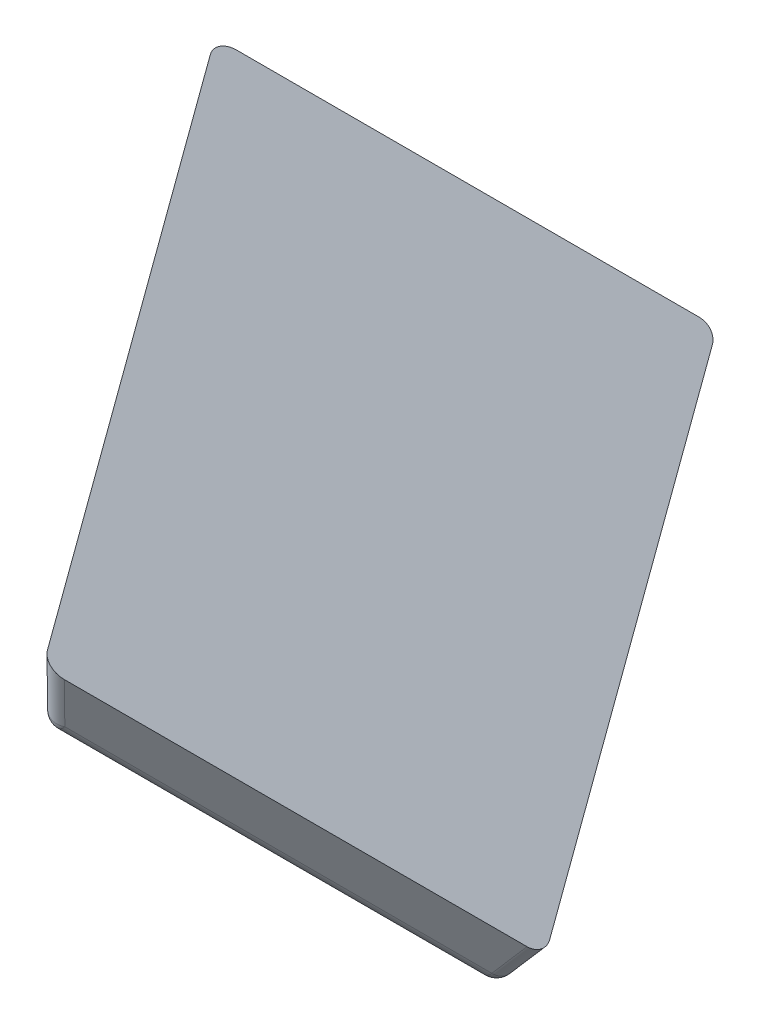
ISO-10303-21;
HEADER;
FILE_DESCRIPTION(('STEP AP214'),'2;1');
FILE_NAME('part.step','',(''),(''),'','','');
FILE_SCHEMA(('AUTOMOTIVE_DESIGN { 1 0 10303 214 1 1 1 1 }'));
ENDSEC;
DATA;
#1=APPLICATION_CONTEXT('core data for automotive mechanical design processes');
#2=APPLICATION_PROTOCOL_DEFINITION('international standard','automotive_design',2000,#1);
#3=PRODUCT_CONTEXT('',#1,'mechanical');
#4=PRODUCT('Part','Part','',(#3));
#5=PRODUCT_RELATED_PRODUCT_CATEGORY('part','',(#4));
#6=PRODUCT_DEFINITION_FORMATION('','',#4);
#7=PRODUCT_DEFINITION_CONTEXT('part definition',#1,'design');
#8=PRODUCT_DEFINITION('design','',#6,#7);
#9=PRODUCT_DEFINITION_SHAPE('','',#8);
#10=(LENGTH_UNIT() NAMED_UNIT(*) SI_UNIT(.MILLI.,.METRE.));
#11=(NAMED_UNIT(*) PLANE_ANGLE_UNIT() SI_UNIT($,.RADIAN.));
#12=(NAMED_UNIT(*) SI_UNIT($,.STERADIAN.) SOLID_ANGLE_UNIT());
#13=UNCERTAINTY_MEASURE_WITH_UNIT(LENGTH_MEASURE(1.E-05),#10,'distance_accuracy_value','');
#14=(GEOMETRIC_REPRESENTATION_CONTEXT(3) GLOBAL_UNCERTAINTY_ASSIGNED_CONTEXT((#13)) GLOBAL_UNIT_ASSIGNED_CONTEXT((#10,
#11,#12)) REPRESENTATION_CONTEXT('',''));
#15=CARTESIAN_POINT('',(0.,0.,0.));
#16=DIRECTION('',(0.,0.,1.));
#17=DIRECTION('',(1.,0.,0.));
#18=AXIS2_PLACEMENT_3D('',#15,#16,#17);
#19=CARTESIAN_POINT('',(10.8333333333333,10.8333333333333,10.8333333333333));
#20=DIRECTION('',(-0.577350269189626,-0.577350269189626,-0.577350269189626));
#21=DIRECTION('',(-0.707106781186548,0.,0.707106781186547));
#22=AXIS2_PLACEMENT_3D('',#19,#20,#21);
#23=PLANE('',#22);
#24=DIRECTION('',(-0.505076272276105,-0.303045763365663,0.808122035641769));
#25=VECTOR('',#24,1.);
#26=CARTESIAN_POINT('',(0.,12.5,20.));
#27=LINE('',#26,#25);
#28=CARTESIAN_POINT('',(12.5,20.,0.));
#29=VERTEX_POINT('',#28);
#30=CARTESIAN_POINT('',(8.57321409974115,17.6439284598447,6.28285744041417));
#31=VERTEX_POINT('',#30);
#32=EDGE_CURVE('E141',#29,#31,#27,.T.);
#33=ORIENTED_EDGE('',*,*,#32,.F.);
#34=DIRECTION('',(0.303045763365663,-0.808122035641769,0.505076272276105));
#35=VECTOR('',#34,1.);
#36=CARTESIAN_POINT('',(12.5,20.,0.));
#37=LINE('',#36,#35);
#38=CARTESIAN_POINT('',(15.6996033261369,11.4677244636351,5.33267221022809));
#39=VERTEX_POINT('',#38);
#40=EDGE_CURVE('E144',#29,#39,#37,.T.);
#41=ORIENTED_EDGE('',*,*,#40,.T.);
#42=DIRECTION('',(0.751882060675628,-0.651631119252211,-0.100250941423417));
#43=VECTOR('',#42,1.);
#44=CARTESIAN_POINT('',(12.8447683722044,13.9419147570432,5.71331687075242));
#45=LINE('',#44,#43);
#46=EDGE_CURVE('E139',#31,#39,#45,.T.);
#47=ORIENTED_EDGE('',*,*,#46,.F.);
#48=EDGE_LOOP('',(#33,#41,#47));
#49=FACE_BOUND('',#48,.T.);
#50=ADVANCED_FACE('F43',(#49),#23,.T.);
#51=CARTESIAN_POINT('',(0.,17.5342465753425,-6.57534246575342));
#52=DIRECTION('',(0.,-0.936329177569045,0.351123441588392));
#53=DIRECTION('',(0.,-0.351123441588392,-0.936329177569045));
#54=AXIS2_PLACEMENT_3D('',#51,#52,#53);
#55=PLANE('',#54);
#56=DIRECTION('',(-0.505076272276106,-0.303045763365663,-0.808122035641769));
#57=VECTOR('',#56,1.);
#58=CARTESIAN_POINT('',(12.5,20.,0.));
#59=LINE('',#58,#57);
#60=CARTESIAN_POINT('',(6.96222501245545,16.6773350074733,-8.86043998007128));
#61=VERTEX_POINT('',#60);
#62=EDGE_CURVE('E167',#29,#61,#59,.T.);
#63=ORIENTED_EDGE('',*,*,#62,.F.);
#64=DIRECTION('',(1.,0.,0.));
#65=VECTOR('',#64,1.);
#66=CARTESIAN_POINT('',(12.5,20.,0.));
#67=LINE('',#66,#65);
#68=CARTESIAN_POINT('',(4.64642819948229,20.,0.));
#69=VERTEX_POINT('',#68);
#70=EDGE_CURVE('E156',#69,#29,#67,.T.);
#71=ORIENTED_EDGE('',*,*,#70,.F.);
#72=DIRECTION('',(-0.237707846515021,0.341059084130247,0.909490891013994));
#73=VECTOR('',#72,1.);
#74=CARTESIAN_POINT('',(6.00533008823189,18.0502712030984,-5.19927679173765));
#75=LINE('',#74,#73);
#76=EDGE_CURVE('E162',#61,#69,#75,.T.);
#77=ORIENTED_EDGE('',*,*,#76,.F.);
#78=EDGE_LOOP('',(#63,#71,#77));
#79=FACE_BOUND('',#78,.T.);
#80=ADVANCED_FACE('F206',(#79),#55,.T.);
#81=CARTESIAN_POINT('',(10.8333333333333,10.8333333333333,-10.8333333333333));
#82=DIRECTION('',(-0.577350269189626,-0.577350269189626,0.577350269189626));
#83=DIRECTION('',(0.,-0.707106781186548,-0.707106781186547));
#84=AXIS2_PLACEMENT_3D('',#81,#82,#83);
#85=PLANE('',#84);
#86=DIRECTION('',(-0.303045763365663,0.808122035641769,0.505076272276105));
#87=VECTOR('',#86,1.);
#88=CARTESIAN_POINT('',(20.,0.,-12.5));
#89=LINE('',#88,#87);
#90=CARTESIAN_POINT('',(16.7486535970014,8.67025707466293,-7.08108932833567));
#91=VERTEX_POINT('',#90);
#92=EDGE_CURVE('E171',#91,#29,#89,.T.);
#93=ORIENTED_EDGE('',*,*,#92,.T.);
#94=ORIENTED_EDGE('',*,*,#62,.T.);
#95=DIRECTION('',(-0.76640631572078,0.627059712862456,-0.139346602858323));
#96=VECTOR('',#95,1.);
#97=CARTESIAN_POINT('',(11.8338590842725,12.6914525850775,-7.97468833065001));
#98=LINE('',#97,#96);
#99=EDGE_CURVE('E150',#91,#61,#98,.T.);
#100=ORIENTED_EDGE('',*,*,#99,.F.);
#101=EDGE_LOOP('',(#93,#94,#100));
#102=FACE_BOUND('',#101,.T.);
#103=ADVANCED_FACE('F275',(#102),#85,.T.);
#104=CARTESIAN_POINT('',(0.,17.5342465753425,6.57534246575342));
#105=DIRECTION('',(0.,0.936329177569044,0.351123441588392));
#106=DIRECTION('',(0.,-0.351123441588392,0.936329177569045));
#107=AXIS2_PLACEMENT_3D('',#104,#105,#106);
#108=PLANE('',#107);
#109=DIRECTION('',(-0.505076272276105,0.303045763365663,-0.808122035641769));
#110=VECTOR('',#109,1.);
#111=CARTESIAN_POINT('',(6.52233937308375,18.8744532958391,3.00145787776232));
#112=LINE('',#111,#110);
#113=EDGE_CURVE('E149',#31,#69,#112,.T.);
#114=ORIENTED_EDGE('',*,*,#113,.T.);
#115=ORIENTED_EDGE('',*,*,#70,.T.);
#116=ORIENTED_EDGE('',*,*,#32,.T.);
#117=EDGE_LOOP('',(#114,#115,#116));
#118=FACE_BOUND('',#117,.T.);
#119=ADVANCED_FACE('F154',(#118),#108,.F.);
#120=CARTESIAN_POINT('',(17.5342465753425,6.57534246575343,0.));
#121=DIRECTION('',(0.936329177569044,0.351123441588392,0.));
#122=DIRECTION('',(-0.351123441588392,0.936329177569045,0.));
#123=AXIS2_PLACEMENT_3D('',#120,#121,#122);
#124=PLANE('',#123);
#125=DIRECTION('',(-0.0821609511956188,0.219095869854983,0.972237922481488));
#126=VECTOR('',#125,1.);
#127=CARTESIAN_POINT('',(16.2260301384986,10.0639196306704,-0.896711736052602));
#128=LINE('',#127,#126);
#129=EDGE_CURVE('E158',#91,#39,#128,.T.);
#130=ORIENTED_EDGE('',*,*,#129,.T.);
#131=ORIENTED_EDGE('',*,*,#40,.F.);
#132=ORIENTED_EDGE('',*,*,#92,.F.);
#133=EDGE_LOOP('',(#130,#131,#132));
#134=FACE_BOUND('',#133,.T.);
#135=ADVANCED_FACE('F202',(#134),#124,.F.);
#136=CARTESIAN_POINT('',(15.4893948071537,18.3056484084544,-2.81625360130067));
#137=DIRECTION('',(0.641533027871785,0.758175396575746,-0.116642368703961));
#138=DIRECTION('',(-0.763386285369115,0.645942241466174,0.));
#139=AXIS2_PLACEMENT_3D('',#136,#137,#138);
#140=PLANE('',#139);
#141=DIRECTION('',(0.577350269189626,-0.577350269189626,-0.577350269189625));
#142=VECTOR('',#141,1.);
#143=CARTESIAN_POINT('',(40.542704217538,-1.19182200689278,8.24339045605658));
#144=LINE('',#143,#142);
#145=CARTESIAN_POINT('',(17.2770908843878,22.0737913262574,31.5090037892067));
#146=VERTEX_POINT('',#145);
#147=CARTESIAN_POINT('',(39.6766788137536,-0.325796603108337,9.10941585984101));
#148=VERTEX_POINT('',#147);
#149=EDGE_CURVE('E47',#146,#148,#144,.T.);
#150=ORIENTED_EDGE('',*,*,#149,.T.);
#151=CARTESIAN_POINT('',(38.9190644053394,0.128772041940155,7.89723280637836));
#152=DIRECTION('',(0.641533027871785,0.758175396575746,-0.116642368703961));
#153=DIRECTION('',(-0.763386285369115,0.645942241466174,0.));
#154=AXIS2_PLACEMENT_3D('',#151,#152,#153);
#155=CIRCLE('',#154,1.5);
#156=CARTESIAN_POINT('',(39.7850898091238,-0.737253361844284,7.03120740259393));
#157=VERTEX_POINT('',#156);
#158=EDGE_CURVE('E404',#148,#157,#155,.T.);
#159=ORIENTED_EDGE('',*,*,#158,.T.);
#160=DIRECTION('',(-0.505076272276105,0.303045763365663,-0.808122035641769));
#161=VECTOR('',#160,1.);
#162=CARTESIAN_POINT('',(12.7635092423522,15.4756949782187,-36.2033215042407));
#163=LINE('',#162,#161);
#164=CARTESIAN_POINT('',(13.5211236507664,15.0211263331702,-34.991138450778));
#165=VERTEX_POINT('',#164);
#166=EDGE_CURVE('E389',#157,#165,#163,.T.);
#167=ORIENTED_EDGE('',*,*,#166,.T.);
#168=CARTESIAN_POINT('',(12.6550982469819,15.8871517369546,-34.1251130469936));
#169=DIRECTION('',(0.641533027871785,0.758175396575746,-0.116642368703961));
#170=DIRECTION('',(-0.763386285369115,0.645942241466174,0.));
#171=AXIS2_PLACEMENT_3D('',#168,#169,#170);
#172=CIRCLE('',#171,1.5);
#173=CARTESIAN_POINT('',(11.8974838385678,16.3417203820031,-35.3372961004563));
#174=VERTEX_POINT('',#173);
#175=EDGE_CURVE('E397',#165,#174,#172,.T.);
#176=ORIENTED_EDGE('',*,*,#175,.T.);
#177=DIRECTION('',(-0.577350269189626,0.577350269189626,0.577350269189625));
#178=VECTOR('',#177,1.);
#179=CARTESIAN_POINT('',(12.7635092423522,15.4756949782187,-36.2033215042407));
#180=LINE('',#179,#178);
#181=CARTESIAN_POINT('',(-10.502104090798,38.7413083113689,-12.9377081710905));
#182=VERTEX_POINT('',#181);
#183=EDGE_CURVE('E388',#174,#182,#180,.T.);
#184=ORIENTED_EDGE('',*,*,#183,.T.);
#185=CARTESIAN_POINT('',(-9.74448968238383,38.2867396663204,-11.7255251176279));
#186=DIRECTION('',(0.641533027871785,0.758175396575746,-0.116642368703961));
#187=DIRECTION('',(-0.577350269189627,0.577350269189626,0.577350269189624));
#188=AXIS2_PLACEMENT_3D('',#185,#186,#187);
#189=ELLIPSE('',#188,1.80277563773199,1.5);
#190=CARTESIAN_POINT('',(-10.7853226821169,39.3275726660535,-10.6846921178948));
#191=VERTEX_POINT('',#190);
#192=EDGE_CURVE('E395',#182,#191,#189,.T.);
#193=ORIENTED_EDGE('',*,*,#192,.T.);
#194=DIRECTION('',(0.505076272276105,-0.303045763365663,0.808122035641769));
#195=VECTOR('',#194,1.);
#196=CARTESIAN_POINT('',(-11.5429370905311,39.7821413111019,-11.8968751713575));
#197=LINE('',#196,#195);
#198=CARTESIAN_POINT('',(15.4786434762406,23.569192971039,31.3376537354771));
#199=VERTEX_POINT('',#198);
#200=EDGE_CURVE('E230',#191,#199,#197,.T.);
#201=ORIENTED_EDGE('',*,*,#200,.T.);
#202=CARTESIAN_POINT('',(16.5194764759736,22.5283599713059,30.2968207357441));
#203=DIRECTION('',(0.641533027871785,0.758175396575746,-0.116642368703961));
#204=DIRECTION('',(-0.577350269189625,0.577350269189626,0.577350269189626));
#205=AXIS2_PLACEMENT_3D('',#202,#203,#204);
#206=ELLIPSE('',#205,1.80277563773199,1.5);
#207=EDGE_CURVE('E402',#199,#146,#206,.T.);
#208=ORIENTED_EDGE('',*,*,#207,.T.);
#209=EDGE_LOOP('',(#150,#159,#167,#176,#184,#193,#201,#208));
#210=FACE_BOUND('',#209,.T.);
#211=ADVANCED_FACE('F191',(#210),#140,.T.);
#212=CARTESIAN_POINT('',(-4.63932809751898,0.331895307176401,3.02404080114051));
#213=DIRECTION('',(0.836242957860706,-0.0598244201615545,-0.545086006223524));
#214=DIRECTION('',(-0.546064053148405,0.,-0.837743427225267));
#215=AXIS2_PLACEMENT_3D('',#212,#213,#214);
#216=PLANE('',#215);
#217=ORIENTED_EDGE('',*,*,#200,.F.);
#218=DIRECTION('',(0.213531437057992,0.951096369490735,0.223203990397779));
#219=VECTOR('',#218,1.);
#220=CARTESIAN_POINT('',(-17.7713111766977,8.21108515468361,-17.9871321255455));
#221=LINE('',#220,#219);
#222=CARTESIAN_POINT('',(-12.153701937029,33.232636204403,-12.1150562566937));
#223=VERTEX_POINT('',#222);
#224=EDGE_CURVE('E348',#191,#223,#221,.F.);
#225=ORIENTED_EDGE('',*,*,#224,.T.);
#226=DIRECTION('',(0.505076272276105,-0.303045763365663,0.808122035641769));
#227=VECTOR('',#226,1.);
#228=CARTESIAN_POINT('',(14.8678786297426,17.01968786434,31.119472650141));
#229=LINE('',#228,#227);
#230=CARTESIAN_POINT('',(14.1102642213284,17.4742565093885,29.9072895966783));
#231=VERTEX_POINT('',#230);
#232=EDGE_CURVE('E343',#223,#231,#229,.T.);
#233=ORIENTED_EDGE('',*,*,#232,.T.);
#234=DIRECTION('',(0.213531437057993,0.951096369490735,0.223203990397781));
#235=VECTOR('',#234,1.);
#236=CARTESIAN_POINT('',(8.49265498165974,-7.54729454033084,24.0352137278265));
#237=LINE('',#236,#235);
#238=EDGE_CURVE('E349',#231,#199,#237,.T.);
#239=ORIENTED_EDGE('',*,*,#238,.T.);
#240=EDGE_LOOP('',(#217,#225,#233,#239));
#241=FACE_BOUND('',#240,.T.);
#242=ADVANCED_FACE('F201',(#241),#216,.F.);
#243=CARTESIAN_POINT('',(13.8895974875929,-8.33375849255574,22.2233559801486));
#244=DIRECTION('',(-0.505076272276105,0.303045763365663,-0.808122035641769));
#245=DIRECTION('',(-0.847998304005089,0.,0.529998940003179));
#246=AXIS2_PLACEMENT_3D('',#243,#244,#245);
#247=PLANE('',#246);
#248=DIRECTION('',(0.577350269189626,-0.577350269189626,-0.577350269189625));
#249=VECTOR('',#248,1.);
#250=CARTESIAN_POINT('',(37.655805592115,-4.60361129148364,8.7682811152244));
#251=LINE('',#250,#249);
#252=CARTESIAN_POINT('',(16.1222430665336,16.9299512340977,30.3018436408057));
#253=VERTEX_POINT('',#252);
#254=CARTESIAN_POINT('',(36.7897801883305,-3.7375858876992,9.63430651900883));
#255=VERTEX_POINT('',#254);
#256=EDGE_CURVE('E445',#253,#255,#251,.T.);
#257=ORIENTED_EDGE('',*,*,#256,.T.);
#258=DIRECTION('',(0.641533027871785,0.758175396575746,-0.11664236870396));
#259=VECTOR('',#258,1.);
#260=CARTESIAN_POINT('',(24.1872840065999,-18.6314450115627,11.9256694611417));
#261=LINE('',#260,#259);
#262=EDGE_CURVE('E406',#255,#148,#261,.T.);
#263=ORIENTED_EDGE('',*,*,#262,.T.);
#264=ORIENTED_EDGE('',*,*,#149,.F.);
#265=DIRECTION('',(0.213531437057992,0.951096369490735,0.223203990397781));
#266=VECTOR('',#265,1.);
#267=CARTESIAN_POINT('',(10.504633826865,-8.09159981562167,24.4297677719538));
#268=LINE('',#267,#266);
#269=EDGE_CURVE('E170',#146,#253,#268,.F.);
#270=ORIENTED_EDGE('',*,*,#269,.T.);
#271=EDGE_LOOP('',(#257,#263,#264,#270));
#272=FACE_BOUND('',#271,.T.);
#273=ADVANCED_FACE('F258',(#272),#247,.F.);
#274=CARTESIAN_POINT('',(11.1637119227914,-11.1637119227914,-11.1637119227914));
#275=DIRECTION('',(-0.577350269189626,0.577350269189626,0.577350269189625));
#276=DIRECTION('',(-0.707106781186547,-0.707106781186548,0.));
#277=AXIS2_PLACEMENT_3D('',#274,#275,#276);
#278=PLANE('',#277);
#279=ORIENTED_EDGE('',*,*,#166,.F.);
#280=DIRECTION('',(0.641533027871785,0.758175396575746,-0.11664236870396));
#281=VECTOR('',#280,1.);
#282=CARTESIAN_POINT('',(24.2956950019701,-19.0429017702987,9.84746100389458));
#283=LINE('',#282,#281);
#284=CARTESIAN_POINT('',(36.8981911837008,-4.14904264643514,7.55609806176175));
#285=VERTEX_POINT('',#284);
#286=EDGE_CURVE('E422',#157,#285,#283,.F.);
#287=ORIENTED_EDGE('',*,*,#286,.T.);
#288=DIRECTION('',(-0.505076272276105,0.303045763365663,-0.808122035641769));
#289=VECTOR('',#288,1.);
#290=CARTESIAN_POINT('',(9.87661061692918,12.0639056936278,-35.6784308450729));
#291=LINE('',#290,#289);
#292=CARTESIAN_POINT('',(10.6342250253433,11.6093370485793,-34.4662477916102));
#293=VERTEX_POINT('',#292);
#294=EDGE_CURVE('E416',#285,#293,#291,.T.);
#295=ORIENTED_EDGE('',*,*,#294,.T.);
#296=DIRECTION('',(0.641533027871784,0.758175396575746,-0.116642368703961));
#297=VECTOR('',#296,1.);
#298=CARTESIAN_POINT('',(-1.96827115638731,-3.28452207528419,-32.1748848494774));
#299=LINE('',#298,#297);
#300=EDGE_CURVE('E420',#293,#165,#299,.T.);
#301=ORIENTED_EDGE('',*,*,#300,.T.);
#302=EDGE_LOOP('',(#279,#287,#295,#301));
#303=FACE_BOUND('',#302,.T.);
#304=ADVANCED_FACE('F203',(#303),#278,.F.);
#305=CARTESIAN_POINT('',(-13.8895974875929,8.33375849255571,-22.2233559801486));
#306=DIRECTION('',(0.505076272276105,-0.303045763365662,0.808122035641769));
#307=DIRECTION('',(0.847998304005088,0.,-0.52999894000318));
#308=AXIS2_PLACEMENT_3D('',#305,#306,#307);
#309=PLANE('',#308);
#310=ORIENTED_EDGE('',*,*,#183,.F.);
#311=DIRECTION('',(0.641533027871784,0.758175396575746,-0.116642368703961));
#312=VECTOR('',#311,1.);
#313=CARTESIAN_POINT('',(-3.59191096858591,-1.96392802645126,-32.5210424991556));
#314=LINE('',#313,#312);
#315=CARTESIAN_POINT('',(9.01058521314474,12.9299310974123,-34.8124054412884));
#316=VERTEX_POINT('',#315);
#317=EDGE_CURVE('E353',#174,#316,#314,.F.);
#318=ORIENTED_EDGE('',*,*,#317,.T.);
#319=DIRECTION('',(-0.577350269189626,0.577350269189626,0.577350269189625));
#320=VECTOR('',#319,1.);
#321=CARTESIAN_POINT('',(-12.1204346391956,34.0609509497526,-13.6813855889482));
#322=LINE('',#321,#320);
#323=CARTESIAN_POINT('',(-11.6569519086521,33.5974682192091,-14.1448683194916));
#324=VERTEX_POINT('',#323);
#325=EDGE_CURVE('E426',#316,#324,#322,.T.);
#326=ORIENTED_EDGE('',*,*,#325,.T.);
#327=DIRECTION('',(0.213531437057992,0.951096369490735,0.22320399039778));
#328=VECTOR('',#327,1.);
#329=CARTESIAN_POINT('',(-17.2745611483208,8.57591716948978,-20.0169441883434));
#330=LINE('',#329,#328);
#331=EDGE_CURVE('E401',#324,#182,#330,.T.);
#332=ORIENTED_EDGE('',*,*,#331,.T.);
#333=EDGE_LOOP('',(#310,#318,#326,#332));
#334=FACE_BOUND('',#333,.T.);
#335=ADVANCED_FACE('F259',(#334),#309,.F.);
#336=CARTESIAN_POINT('',(11.640196639923,13.7565960289999,-2.11639938907691));
#337=DIRECTION('',(-0.641533027871785,-0.758175396575746,0.116642368703961));
#338=DIRECTION('',(0.763386285369114,-0.645942241466174,0.));
#339=AXIS2_PLACEMENT_3D('',#336,#337,#338);
#340=PLANE('',#339);
#341=DIRECTION('',(0.505076272276105,-0.303045763365663,0.808122035641769));
#342=VECTOR('',#341,1.);
#343=CARTESIAN_POINT('',(-12.6192514504598,32.4602051243455,-13.9699047664357));
#344=LINE('',#343,#342);
#345=CARTESIAN_POINT('',(14.4023291163118,16.2472567842826,29.264624140399));
#346=VERTEX_POINT('',#345);
#347=CARTESIAN_POINT('',(-11.8616370420457,32.005636479297,-12.757721712973));
#348=VERTEX_POINT('',#347);
#349=EDGE_CURVE('E351',#346,#348,#344,.F.);
#350=ORIENTED_EDGE('',*,*,#349,.T.);
#351=DIRECTION('',(-0.577350269189626,0.577350269189626,0.577350269189625));
#352=VECTOR('',#351,1.);
#353=CARTESIAN_POINT('',(9.67192548353566,10.4720739537157,-34.2912842385543));
#354=LINE('',#353,#352);
#355=CARTESIAN_POINT('',(8.80590007975122,11.3380993575002,-33.4252588347698));
#356=VERTEX_POINT('',#355);
#357=EDGE_CURVE('E12',#348,#356,#354,.F.);
#358=ORIENTED_EDGE('',*,*,#357,.T.);
#359=DIRECTION('',(-0.505076272276105,0.303045763365663,-0.808122035641769));
#360=VECTOR('',#359,1.);
#361=CARTESIAN_POINT('',(35.8274806465228,-4.87484898256282,9.80927007206479));
#362=LINE('',#361,#360);
#363=CARTESIAN_POINT('',(35.0698662381087,-4.42028033751432,8.59708701860213));
#364=VERTEX_POINT('',#363);
#365=EDGE_CURVE('E53',#356,#364,#362,.F.);
#366=ORIENTED_EDGE('',*,*,#365,.T.);
#367=DIRECTION('',(0.577350269189626,-0.577350269189626,-0.577350269189625));
#368=VECTOR('',#367,1.);
#369=CARTESIAN_POINT('',(13.9388463857684,16.710739514826,29.7281068709424));
#370=LINE('',#369,#368);
#371=EDGE_CURVE('E361',#364,#346,#370,.F.);
#372=ORIENTED_EDGE('',*,*,#371,.T.);
#373=EDGE_LOOP('',(#350,#358,#366,#372));
#374=FACE_BOUND('',#373,.T.);
#375=ORIENTED_EDGE('',*,*,#113,.F.);
#376=ORIENTED_EDGE('',*,*,#46,.T.);
#377=ORIENTED_EDGE('',*,*,#129,.F.);
#378=ORIENTED_EDGE('',*,*,#99,.T.);
#379=ORIENTED_EDGE('',*,*,#76,.T.);
#380=EDGE_LOOP('',(#375,#376,#377,#378,#379));
#381=FACE_BOUND('',#380,.T.);
#382=ADVANCED_FACE('F160',(#374,#381),#340,.T.);
#383=CARTESIAN_POINT('',(-16.5169467399067,8.12134852444128,-18.8047611348808));
#384=DIRECTION('',(0.213531437057992,0.951096369490735,0.223203990397779));
#385=DIRECTION('',(0.,-0.228473458117671,0.973550141973054));
#386=AXIS2_PLACEMENT_3D('',#383,#384,#385);
#387=CYLINDRICAL_SURFACE('',#386,1.5);
#388=CARTESIAN_POINT('',(-10.899337500238,33.1428995741606,-12.9326852660289));
#389=DIRECTION('',(-0.213531437057994,-0.951096369490733,-0.223203990397785));
#390=DIRECTION('',(0.,0.228473458117677,-0.973550141973052));
#391=AXIS2_PLACEMENT_3D('',#388,#389,#390);
#392=CIRCLE('',#391,1.5);
#393=EDGE_CURVE('E335',#223,#324,#392,.T.);
#394=ORIENTED_EDGE('',*,*,#393,.F.);
#395=ORIENTED_EDGE('',*,*,#224,.F.);
#396=ORIENTED_EDGE('',*,*,#192,.F.);
#397=ORIENTED_EDGE('',*,*,#331,.F.);
#398=EDGE_LOOP('',(#394,#395,#396,#397));
#399=FACE_BOUND('',#398,.T.);
#400=ADVANCED_FACE('F45',(#399),#387,.T.);
#401=CARTESIAN_POINT('',(-10.899337500238,33.1428995741607,-12.9326852660289));
#402=DIRECTION('',(0.,0.,1.));
#403=DIRECTION('',(1.,0.,0.));
#404=AXIS2_PLACEMENT_3D('',#401,#402,#403);
#405=SPHERICAL_SURFACE('',#404,1.5);
#406=CARTESIAN_POINT('',(-10.899337500238,33.1428995741607,-12.9326852660289));
#407=DIRECTION('',(-0.505076272276109,0.303045763365667,-0.808122035641765));
#408=DIRECTION('',(-0.847998304005085,0.,0.529998940003184));
#409=AXIS2_PLACEMENT_3D('',#406,#407,#408);
#410=CIRCLE('',#409,1.5);
#411=EDGE_CURVE('E332',#223,#348,#410,.F.);
#412=ORIENTED_EDGE('',*,*,#411,.F.);
#413=ORIENTED_EDGE('',*,*,#393,.T.);
#414=CARTESIAN_POINT('',(-10.899337500238,33.1428995741607,-12.9326852660289));
#415=DIRECTION('',(-0.577350269189625,0.577350269189626,0.577350269189626));
#416=DIRECTION('',(0.,-0.707106781186548,0.707106781186547));
#417=AXIS2_PLACEMENT_3D('',#414,#415,#416);
#418=CIRCLE('',#417,1.5);
#419=EDGE_CURVE('E337',#348,#324,#418,.F.);
#420=ORIENTED_EDGE('',*,*,#419,.F.);
#421=EDGE_LOOP('',(#412,#413,#420));
#422=FACE_BOUND('',#421,.T.);
#423=ADVANCED_FACE('F320',(#422),#405,.T.);
#424=CARTESIAN_POINT('',(-2.83429656017175,-2.41849667149975,-31.3088594456929));
#425=DIRECTION('',(0.641533027871784,0.758175396575746,-0.116642368703961));
#426=DIRECTION('',(-0.763386285369115,0.645942241466173,0.));
#427=AXIS2_PLACEMENT_3D('',#424,#425,#426);
#428=CYLINDRICAL_SURFACE('',#427,1.5);
#429=ORIENTED_EDGE('',*,*,#175,.F.);
#430=ORIENTED_EDGE('',*,*,#300,.F.);
#431=CARTESIAN_POINT('',(9.7681996215589,12.4753624523638,-33.6002223878258));
#432=DIRECTION('',(-0.641533027871784,-0.758175396575746,0.116642368703962));
#433=DIRECTION('',(0.763386285369115,-0.645942241466173,0.));
#434=AXIS2_PLACEMENT_3D('',#431,#432,#433);
#435=CIRCLE('',#434,1.5);
#436=EDGE_CURVE('E340',#316,#293,#435,.T.);
#437=ORIENTED_EDGE('',*,*,#436,.F.);
#438=ORIENTED_EDGE('',*,*,#317,.F.);
#439=EDGE_LOOP('',(#429,#430,#437,#438));
#440=FACE_BOUND('',#439,.T.);
#441=ADVANCED_FACE('F317',(#440),#428,.T.);
#442=CARTESIAN_POINT('',(-0.529486897448068,22.7730489713707,-23.3025358688188));
#443=DIRECTION('',(0.577350269189626,-0.577350269189626,-0.577350269189625));
#444=DIRECTION('',(0.707106781186548,0.707106781186548,0.));
#445=AXIS2_PLACEMENT_3D('',#442,#443,#444);
#446=CYLINDRICAL_SURFACE('',#445,1.5);
#447=ORIENTED_EDGE('',*,*,#419,.T.);
#448=ORIENTED_EDGE('',*,*,#325,.F.);
#449=CARTESIAN_POINT('',(9.76819962155889,12.4753624523638,-33.6002223878258));
#450=DIRECTION('',(0.577350269189629,-0.577350269189627,-0.577350269189621));
#451=DIRECTION('',(0.707106781186547,0.707106781186548,0.));
#452=AXIS2_PLACEMENT_3D('',#449,#450,#451);
#453=CIRCLE('',#452,1.5);
#454=EDGE_CURVE('E381',#356,#316,#453,.T.);
#455=ORIENTED_EDGE('',*,*,#454,.F.);
#456=ORIENTED_EDGE('',*,*,#357,.F.);
#457=EDGE_LOOP('',(#447,#448,#455,#456));
#458=FACE_BOUND('',#457,.T.);
#459=ADVANCED_FACE('F313',(#458),#446,.T.);
#460=CARTESIAN_POINT('',(2.23264557894075,25.2637097266534,8.07848766065705));
#461=DIRECTION('',(-0.505076272276105,0.303045763365663,-0.808122035641769));
#462=DIRECTION('',(-0.847998304005088,0.,0.52999894000318));
#463=AXIS2_PLACEMENT_3D('',#460,#461,#462);
#464=CYLINDRICAL_SURFACE('',#463,1.5);
#465=ORIENTED_EDGE('',*,*,#411,.T.);
#466=ORIENTED_EDGE('',*,*,#349,.F.);
#467=CARTESIAN_POINT('',(15.3646286581195,17.3845198791462,29.089660587343));
#468=DIRECTION('',(0.505076272276106,-0.303045763365663,0.808122035641769));
#469=DIRECTION('',(0.847998304005088,0.,-0.52999894000318));
#470=AXIS2_PLACEMENT_3D('',#467,#468,#469);
#471=CIRCLE('',#470,1.5);
#472=EDGE_CURVE('E345',#231,#346,#471,.T.);
#473=ORIENTED_EDGE('',*,*,#472,.F.);
#474=ORIENTED_EDGE('',*,*,#232,.F.);
#475=EDGE_LOOP('',(#465,#466,#473,#474));
#476=FACE_BOUND('',#475,.T.);
#477=ADVANCED_FACE('F309',(#476),#464,.T.);
#478=CARTESIAN_POINT('',(9.7470194184508,-7.63703117057318,23.2175847184912));
#479=DIRECTION('',(0.213531437057993,0.951096369490735,0.223203990397781));
#480=DIRECTION('',(0.,-0.228473458117672,0.973550141973053));
#481=AXIS2_PLACEMENT_3D('',#478,#479,#480);
#482=CYLINDRICAL_SURFACE('',#481,1.5);
#483=ORIENTED_EDGE('',*,*,#207,.F.);
#484=ORIENTED_EDGE('',*,*,#238,.F.);
#485=CARTESIAN_POINT('',(15.3646286581195,17.3845198791462,29.089660587343));
#486=DIRECTION('',(-0.213531437057994,-0.951096369490734,-0.22320399039778));
#487=DIRECTION('',(0.,0.228473458117672,-0.973550141973053));
#488=AXIS2_PLACEMENT_3D('',#485,#486,#487);
#489=CIRCLE('',#488,1.5);
#490=EDGE_CURVE('E378',#253,#231,#489,.T.);
#491=ORIENTED_EDGE('',*,*,#490,.F.);
#492=ORIENTED_EDGE('',*,*,#269,.F.);
#493=EDGE_LOOP('',(#483,#484,#491,#492));
#494=FACE_BOUND('',#493,.T.);
#495=ADVANCED_FACE('F305',(#494),#482,.T.);
#496=CARTESIAN_POINT('',(9.7681996215589,12.4753624523638,-33.6002223878258));
#497=DIRECTION('',(0.,0.,1.));
#498=DIRECTION('',(1.,0.,0.));
#499=AXIS2_PLACEMENT_3D('',#496,#497,#498);
#500=SPHERICAL_SURFACE('',#499,1.5);
#501=ORIENTED_EDGE('',*,*,#454,.T.);
#502=ORIENTED_EDGE('',*,*,#436,.T.);
#503=CARTESIAN_POINT('',(9.7681996215589,12.4753624523638,-33.6002223878258));
#504=DIRECTION('',(-0.505076272276106,0.303045763365661,-0.808122035641769));
#505=DIRECTION('',(-0.847998304005088,0.,0.52999894000318));
#506=AXIS2_PLACEMENT_3D('',#503,#504,#505);
#507=CIRCLE('',#506,1.5);
#508=EDGE_CURVE('E376',#356,#293,#507,.F.);
#509=ORIENTED_EDGE('',*,*,#508,.F.);
#510=EDGE_LOOP('',(#501,#502,#509));
#511=FACE_BOUND('',#510,.T.);
#512=ADVANCED_FACE('F301',(#511),#500,.T.);
#513=CARTESIAN_POINT('',(15.3646286581195,17.3845198791462,29.089660587343));
#514=DIRECTION('',(0.,0.,1.));
#515=DIRECTION('',(1.,0.,0.));
#516=AXIS2_PLACEMENT_3D('',#513,#514,#515);
#517=SPHERICAL_SURFACE('',#516,1.5);
#518=ORIENTED_EDGE('',*,*,#490,.T.);
#519=ORIENTED_EDGE('',*,*,#472,.T.);
#520=CARTESIAN_POINT('',(15.3646286581195,17.3845198791462,29.089660587343));
#521=DIRECTION('',(-0.577350269189623,0.577350269189623,0.577350269189632));
#522=DIRECTION('',(0.,-0.707106781186553,0.707106781186542));
#523=AXIS2_PLACEMENT_3D('',#520,#521,#522);
#524=CIRCLE('',#523,1.5);
#525=EDGE_CURVE('E373',#253,#346,#524,.F.);
#526=ORIENTED_EDGE('',*,*,#525,.F.);
#527=EDGE_LOOP('',(#518,#519,#526));
#528=FACE_BOUND('',#527,.T.);
#529=ADVANCED_FACE('F298',(#528),#517,.T.);
#530=CARTESIAN_POINT('',(22.9001827007376,4.59617260485653,-12.5890494611398));
#531=DIRECTION('',(0.505076272276105,-0.303045763365663,0.808122035641769));
#532=DIRECTION('',(0.847998304005088,0.,-0.52999894000318));
#533=AXIS2_PLACEMENT_3D('',#530,#531,#532);
#534=CYLINDRICAL_SURFACE('',#533,1.5);
#535=ORIENTED_EDGE('',*,*,#508,.T.);
#536=ORIENTED_EDGE('',*,*,#294,.F.);
#537=CARTESIAN_POINT('',(36.0321657799164,-3.2830172426507,8.42212346554619));
#538=DIRECTION('',(0.505076272276106,-0.303045763365663,0.808122035641768));
#539=DIRECTION('',(0.847998304005087,0.,-0.529998940003181));
#540=AXIS2_PLACEMENT_3D('',#537,#538,#539);
#541=CIRCLE('',#540,1.5);
#542=EDGE_CURVE('E370',#364,#285,#541,.T.);
#543=ORIENTED_EDGE('',*,*,#542,.F.);
#544=ORIENTED_EDGE('',*,*,#365,.F.);
#545=EDGE_LOOP('',(#535,#536,#543,#544));
#546=FACE_BOUND('',#545,.T.);
#547=ADVANCED_FACE('F294',(#546),#534,.T.);
#548=CARTESIAN_POINT('',(25.7344792609094,7.01466927635627,18.7198099845531));
#549=DIRECTION('',(-0.577350269189626,0.577350269189626,0.577350269189625));
#550=DIRECTION('',(-0.707106781186548,-0.707106781186548,0.));
#551=AXIS2_PLACEMENT_3D('',#548,#549,#550);
#552=CYLINDRICAL_SURFACE('',#551,1.5);
#553=ORIENTED_EDGE('',*,*,#525,.T.);
#554=ORIENTED_EDGE('',*,*,#371,.F.);
#555=CARTESIAN_POINT('',(36.0321657799164,-3.2830172426507,8.42212346554618));
#556=DIRECTION('',(0.577350269189621,-0.57735026918963,-0.577350269189626));
#557=DIRECTION('',(0.,0.707106781186545,-0.70710678118655));
#558=AXIS2_PLACEMENT_3D('',#555,#556,#557);
#559=CIRCLE('',#558,1.5);
#560=EDGE_CURVE('E367',#255,#364,#559,.T.);
#561=ORIENTED_EDGE('',*,*,#560,.F.);
#562=ORIENTED_EDGE('',*,*,#256,.F.);
#563=EDGE_LOOP('',(#553,#554,#561,#562));
#564=FACE_BOUND('',#563,.T.);
#565=ADVANCED_FACE('F290',(#564),#552,.T.);
#566=CARTESIAN_POINT('',(36.0321657799164,-3.28301724265071,8.42212346554618));
#567=DIRECTION('',(0.,0.,1.));
#568=DIRECTION('',(1.,0.,0.));
#569=AXIS2_PLACEMENT_3D('',#566,#567,#568);
#570=SPHERICAL_SURFACE('',#569,1.5);
#571=ORIENTED_EDGE('',*,*,#560,.T.);
#572=ORIENTED_EDGE('',*,*,#542,.T.);
#573=CARTESIAN_POINT('',(36.0321657799164,-3.28301724265071,8.42212346554618));
#574=DIRECTION('',(-0.641533027871782,-0.758175396575748,0.116642368703963));
#575=DIRECTION('',(0.763386285369117,-0.645942241466171,0.));
#576=AXIS2_PLACEMENT_3D('',#573,#574,#575);
#577=CIRCLE('',#576,1.5);
#578=EDGE_CURVE('E364',#255,#285,#577,.F.);
#579=ORIENTED_EDGE('',*,*,#578,.F.);
#580=EDGE_LOOP('',(#571,#572,#579));
#581=FACE_BOUND('',#580,.T.);
#582=ADVANCED_FACE('F286',(#581),#570,.T.);
#583=CARTESIAN_POINT('',(23.4296695981857,-18.1768763665142,10.713486407679));
#584=DIRECTION('',(0.641533027871785,0.758175396575746,-0.11664236870396));
#585=DIRECTION('',(-0.763386285369114,0.645942241466174,0.));
#586=AXIS2_PLACEMENT_3D('',#583,#584,#585);
#587=CYLINDRICAL_SURFACE('',#586,1.5);
#588=ORIENTED_EDGE('',*,*,#578,.T.);
#589=ORIENTED_EDGE('',*,*,#286,.F.);
#590=ORIENTED_EDGE('',*,*,#158,.F.);
#591=ORIENTED_EDGE('',*,*,#262,.F.);
#592=EDGE_LOOP('',(#588,#589,#590,#591));
#593=FACE_BOUND('',#592,.T.);
#594=ADVANCED_FACE('F283',(#593),#587,.T.);
#595=CLOSED_SHELL('',(#50,#80,#103,#119,#135,#211,#242,#273,#304,#335,#382,#400,#423,#441,#459,
#477,#495,#512,#529,#547,#565,#582,#594));
#596=MANIFOLD_SOLID_BREP('B2',#595);
#597=ADVANCED_BREP_SHAPE_REPRESENTATION('',(#18,#596),#14);
#598=SHAPE_DEFINITION_REPRESENTATION(#9,#597);
ENDSEC;
END-ISO-10303-21;
